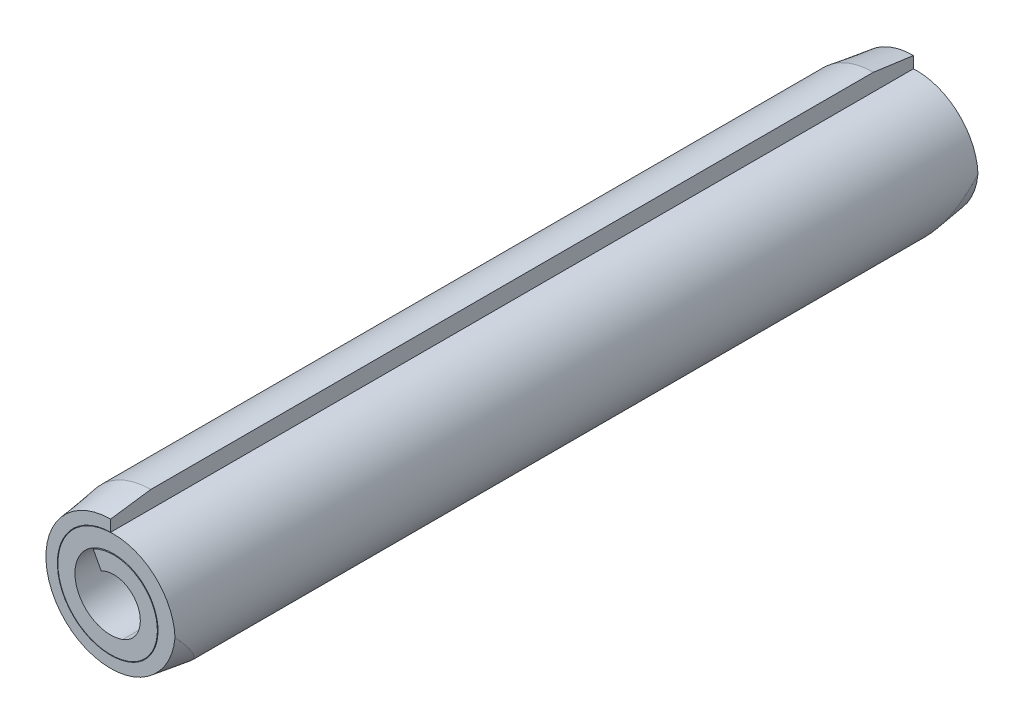
ISO-10303-21;
HEADER;
FILE_DESCRIPTION(('STEP AP214'),'2;1');
FILE_NAME('part.step','',(''),(''),'','','');
FILE_SCHEMA(('AUTOMOTIVE_DESIGN { 1 0 10303 214 1 1 1 1 }'));
ENDSEC;
DATA;
#1=APPLICATION_CONTEXT('core data for automotive mechanical design processes');
#2=APPLICATION_PROTOCOL_DEFINITION('international standard','automotive_design',2000,#1);
#3=PRODUCT_CONTEXT('',#1,'mechanical');
#4=PRODUCT('Part','Part','',(#3));
#5=PRODUCT_RELATED_PRODUCT_CATEGORY('part','',(#4));
#6=PRODUCT_DEFINITION_FORMATION('','',#4);
#7=PRODUCT_DEFINITION_CONTEXT('part definition',#1,'design');
#8=PRODUCT_DEFINITION('design','',#6,#7);
#9=PRODUCT_DEFINITION_SHAPE('','',#8);
#10=(LENGTH_UNIT() NAMED_UNIT(*) SI_UNIT(.MILLI.,.METRE.));
#11=(NAMED_UNIT(*) PLANE_ANGLE_UNIT() SI_UNIT($,.RADIAN.));
#12=(NAMED_UNIT(*) SI_UNIT($,.STERADIAN.) SOLID_ANGLE_UNIT());
#13=UNCERTAINTY_MEASURE_WITH_UNIT(LENGTH_MEASURE(1.E-05),#10,'distance_accuracy_value','');
#14=(GEOMETRIC_REPRESENTATION_CONTEXT(3) GLOBAL_UNCERTAINTY_ASSIGNED_CONTEXT((#13)) GLOBAL_UNIT_ASSIGNED_CONTEXT((#10,
#11,#12)) REPRESENTATION_CONTEXT('',''));
#15=CARTESIAN_POINT('',(0.,0.,0.));
#16=DIRECTION('',(0.,0.,1.));
#17=DIRECTION('',(1.,0.,0.));
#18=AXIS2_PLACEMENT_3D('',#15,#16,#17);
#19=CARTESIAN_POINT('',(-0.211085830625034,0.338291437783564,-9.));
#20=DIRECTION('',(0.883353817881994,0.468706765935062,0.));
#21=DIRECTION('',(-0.468706765935062,0.883353817881994,0.));
#22=AXIS2_PLACEMENT_3D('',#19,#20,#21);
#23=PLANE('',#22);
#24=DIRECTION('',(0.,0.,1.));
#25=VECTOR('',#24,1.);
#26=CARTESIAN_POINT('',(-0.390102521039357,0.675677386600868,-9.));
#27=LINE('',#26,#25);
#28=CARTESIAN_POINT('',(-0.390102521039357,0.675677386600868,-9.));
#29=VERTEX_POINT('',#28);
#30=CARTESIAN_POINT('',(-0.390102521039357,0.675677386600868,9.));
#31=VERTEX_POINT('',#30);
#32=EDGE_CURVE('E241',#29,#31,#27,.T.);
#33=ORIENTED_EDGE('',*,*,#32,.F.);
#34=DIRECTION('',(-0.468706765935062,0.883353817881994,0.));
#35=VECTOR('',#34,1.);
#36=CARTESIAN_POINT('',(-0.211085830625034,0.338291437783564,-9.));
#37=LINE('',#36,#35);
#38=CARTESIAN_POINT('',(-0.211085830625034,0.338291437783564,-9.));
#39=VERTEX_POINT('',#38);
#40=EDGE_CURVE('E125',#39,#29,#37,.T.);
#41=ORIENTED_EDGE('',*,*,#40,.F.);
#42=DIRECTION('',(0.,0.,1.));
#43=VECTOR('',#42,1.);
#44=CARTESIAN_POINT('',(-0.211085830625034,0.338291437783564,-9.));
#45=LINE('',#44,#43);
#46=CARTESIAN_POINT('',(-0.211085830625034,0.338291437783564,9.));
#47=VERTEX_POINT('',#46);
#48=EDGE_CURVE('E109',#47,#39,#45,.F.);
#49=ORIENTED_EDGE('',*,*,#48,.F.);
#50=DIRECTION('',(-0.468706765935062,0.883353817881994,0.));
#51=VECTOR('',#50,1.);
#52=CARTESIAN_POINT('',(-0.211085830625034,0.338291437783564,9.));
#53=LINE('',#52,#51);
#54=EDGE_CURVE('E116',#31,#47,#53,.F.);
#55=ORIENTED_EDGE('',*,*,#54,.F.);
#56=EDGE_LOOP('',(#33,#41,#49,#55));
#57=FACE_BOUND('',#56,.T.);
#58=ADVANCED_FACE('F16',(#57),#23,.F.);
#59=CARTESIAN_POINT('',(0.0689996919525346,-0.189575095588917,-9.));
#60=DIRECTION('',(0.,0.,1.));
#61=DIRECTION('',(1.,0.,0.));
#62=AXIS2_PLACEMENT_3D('',#59,#60,#61);
#63=CYLINDRICAL_SURFACE('',#62,0.597570897059278);
#64=CARTESIAN_POINT('',(0.0689996919525346,-0.189575095588917,-9.));
#65=DIRECTION('',(0.,0.,1.));
#66=DIRECTION('',(1.,0.,0.));
#67=AXIS2_PLACEMENT_3D('',#64,#65,#66);
#68=CIRCLE('',#67,0.597570897059278);
#69=CARTESIAN_POINT('',(0.273380975811996,-0.751108057951937,-9.));
#70=VERTEX_POINT('',#69);
#71=EDGE_CURVE('E101',#70,#39,#68,.T.);
#72=ORIENTED_EDGE('',*,*,#71,.F.);
#73=DIRECTION('',(0.,0.,1.));
#74=VECTOR('',#73,1.);
#75=CARTESIAN_POINT('',(0.273380975811998,-0.751108057951936,-9.));
#76=LINE('',#75,#74);
#77=CARTESIAN_POINT('',(0.273380975811996,-0.751108057951937,9.));
#78=VERTEX_POINT('',#77);
#79=EDGE_CURVE('E112',#70,#78,#76,.T.);
#80=ORIENTED_EDGE('',*,*,#79,.T.);
#81=CARTESIAN_POINT('',(0.0689996919525346,-0.189575095588917,9.));
#82=DIRECTION('',(0.,0.,1.));
#83=DIRECTION('',(1.,0.,0.));
#84=AXIS2_PLACEMENT_3D('',#81,#82,#83);
#85=CIRCLE('',#84,0.597570897059278);
#86=EDGE_CURVE('E19',#47,#78,#85,.F.);
#87=ORIENTED_EDGE('',*,*,#86,.F.);
#88=ORIENTED_EDGE('',*,*,#48,.T.);
#89=EDGE_LOOP('',(#72,#80,#87,#88));
#90=FACE_BOUND('',#89,.T.);
#91=ADVANCED_FACE('F107',(#90),#63,.F.);
#92=CARTESIAN_POINT('',(0.,0.,-9.));
#93=DIRECTION('',(0.,0.,1.));
#94=DIRECTION('',(1.,0.,0.));
#95=AXIS2_PLACEMENT_3D('',#92,#93,#94);
#96=CYLINDRICAL_SURFACE('',#95,1.18125);
#97=CARTESIAN_POINT('',(0.,0.,-9.));
#98=DIRECTION('',(0.,0.,1.));
#99=DIRECTION('',(1.,0.,0.));
#100=AXIS2_PLACEMENT_3D('',#97,#98,#99);
#101=CIRCLE('',#100,1.18125);
#102=CARTESIAN_POINT('',(-0.404011294303447,1.11001190830335,-9.));
#103=VERTEX_POINT('',#102);
#104=CARTESIAN_POINT('',(0.404011294303443,-1.11001190830336,-9.));
#105=VERTEX_POINT('',#104);
#106=EDGE_CURVE('E261',#103,#105,#101,.T.);
#107=ORIENTED_EDGE('',*,*,#106,.T.);
#108=DIRECTION('',(0.,0.,1.));
#109=VECTOR('',#108,1.);
#110=CARTESIAN_POINT('',(0.404011294303446,-1.11001190830335,-9.));
#111=LINE('',#110,#109);
#112=CARTESIAN_POINT('',(0.404011294303443,-1.11001190830336,9.));
#113=VERTEX_POINT('',#112);
#114=EDGE_CURVE('E243',#105,#113,#111,.T.);
#115=ORIENTED_EDGE('',*,*,#114,.T.);
#116=CARTESIAN_POINT('',(0.,0.,9.));
#117=DIRECTION('',(0.,0.,1.));
#118=DIRECTION('',(1.,0.,0.));
#119=AXIS2_PLACEMENT_3D('',#116,#117,#118);
#120=CIRCLE('',#119,1.18125);
#121=CARTESIAN_POINT('',(-0.404011294303447,1.11001190830335,9.));
#122=VERTEX_POINT('',#121);
#123=EDGE_CURVE('E253',#122,#113,#120,.T.);
#124=ORIENTED_EDGE('',*,*,#123,.F.);
#125=DIRECTION('',(0.,0.,1.));
#126=VECTOR('',#125,1.);
#127=CARTESIAN_POINT('',(-0.404011294303447,1.11001190830335,-9.));
#128=LINE('',#127,#126);
#129=EDGE_CURVE('E232',#103,#122,#128,.T.);
#130=ORIENTED_EDGE('',*,*,#129,.F.);
#131=EDGE_LOOP('',(#107,#115,#124,#130));
#132=FACE_BOUND('',#131,.T.);
#133=ADVANCED_FACE('F180',(#132),#96,.T.);
#134=CARTESIAN_POINT('',(0.0689996919525346,-0.189575095588917,-9.));
#135=DIRECTION('',(0.,0.,1.));
#136=DIRECTION('',(1.,0.,0.));
#137=AXIS2_PLACEMENT_3D('',#134,#135,#136);
#138=CYLINDRICAL_SURFACE('',#137,0.979508397059278);
#139=ORIENTED_EDGE('',*,*,#32,.T.);
#140=CARTESIAN_POINT('',(0.0689996919525346,-0.189575095588917,9.));
#141=DIRECTION('',(0.,0.,1.));
#142=DIRECTION('',(1.,0.,0.));
#143=AXIS2_PLACEMENT_3D('',#140,#141,#142);
#144=CIRCLE('',#143,0.979508397059278);
#145=EDGE_CURVE('E121',#113,#31,#144,.T.);
#146=ORIENTED_EDGE('',*,*,#145,.F.);
#147=ORIENTED_EDGE('',*,*,#114,.F.);
#148=CARTESIAN_POINT('',(0.0689996919525346,-0.189575095588917,-9.));
#149=DIRECTION('',(0.,0.,1.));
#150=DIRECTION('',(1.,0.,0.));
#151=AXIS2_PLACEMENT_3D('',#148,#149,#150);
#152=CIRCLE('',#151,0.979508397059278);
#153=EDGE_CURVE('E263',#105,#29,#152,.T.);
#154=ORIENTED_EDGE('',*,*,#153,.T.);
#155=EDGE_LOOP('',(#139,#146,#147,#154));
#156=FACE_BOUND('',#155,.T.);
#157=ADVANCED_FACE('F176',(#156),#138,.T.);
#158=CARTESIAN_POINT('',(0.,0.,-9.));
#159=DIRECTION('',(0.,0.,1.));
#160=DIRECTION('',(1.,0.,0.));
#161=AXIS2_PLACEMENT_3D('',#158,#159,#160);
#162=CYLINDRICAL_SURFACE('',#161,0.799312499999999);
#163=ORIENTED_EDGE('',*,*,#79,.F.);
#164=CARTESIAN_POINT('',(0.,0.,-9.));
#165=DIRECTION('',(0.,0.,1.));
#166=DIRECTION('',(1.,0.,0.));
#167=AXIS2_PLACEMENT_3D('',#164,#165,#166);
#168=CIRCLE('',#167,0.799312499999999);
#169=CARTESIAN_POINT('',(-0.273380975811999,0.751108057951935,-9.));
#170=VERTEX_POINT('',#169);
#171=EDGE_CURVE('E266',#70,#170,#168,.F.);
#172=ORIENTED_EDGE('',*,*,#171,.T.);
#173=DIRECTION('',(0.,0.,1.));
#174=VECTOR('',#173,1.);
#175=CARTESIAN_POINT('',(-0.273380975811999,0.751108057951935,-9.));
#176=LINE('',#175,#174);
#177=CARTESIAN_POINT('',(-0.273380975811999,0.751108057951935,9.));
#178=VERTEX_POINT('',#177);
#179=EDGE_CURVE('E235',#170,#178,#176,.T.);
#180=ORIENTED_EDGE('',*,*,#179,.T.);
#181=CARTESIAN_POINT('',(0.,0.,9.));
#182=DIRECTION('',(0.,0.,1.));
#183=DIRECTION('',(1.,0.,0.));
#184=AXIS2_PLACEMENT_3D('',#181,#182,#183);
#185=CIRCLE('',#184,0.799312499999999);
#186=EDGE_CURVE('E256',#78,#178,#185,.F.);
#187=ORIENTED_EDGE('',*,*,#186,.F.);
#188=EDGE_LOOP('',(#163,#172,#180,#187));
#189=FACE_BOUND('',#188,.T.);
#190=ADVANCED_FACE('F172',(#189),#162,.F.);
#191=CARTESIAN_POINT('',(0.0673352157172413,-0.185001984717226,-9.));
#192=DIRECTION('',(0.,0.,1.));
#193=DIRECTION('',(1.,0.,0.));
#194=AXIS2_PLACEMENT_3D('',#191,#192,#193);
#195=CYLINDRICAL_SURFACE('',#194,0.996187499999999);
#196=CARTESIAN_POINT('',(0.0673352157172413,-0.185001984717226,-9.));
#197=DIRECTION('',(0.,0.,1.));
#198=DIRECTION('',(1.,0.,0.));
#199=AXIS2_PLACEMENT_3D('',#196,#197,#198);
#200=CIRCLE('',#199,0.996187499999999);
#201=CARTESIAN_POINT('',(0.408051407246481,-1.12111202738639,-9.));
#202=VERTEX_POINT('',#201);
#203=EDGE_CURVE('E268',#170,#202,#200,.F.);
#204=ORIENTED_EDGE('',*,*,#203,.T.);
#205=DIRECTION('',(0.,0.,1.));
#206=VECTOR('',#205,1.);
#207=CARTESIAN_POINT('',(0.408051407246481,-1.12111202738639,-9.));
#208=LINE('',#207,#206);
#209=CARTESIAN_POINT('',(0.408051407246481,-1.12111202738639,9.));
#210=VERTEX_POINT('',#209);
#211=EDGE_CURVE('E229',#202,#210,#208,.T.);
#212=ORIENTED_EDGE('',*,*,#211,.T.);
#213=CARTESIAN_POINT('',(0.0673352157172413,-0.185001984717226,9.));
#214=DIRECTION('',(0.,0.,1.));
#215=DIRECTION('',(1.,0.,0.));
#216=AXIS2_PLACEMENT_3D('',#213,#214,#215);
#217=CIRCLE('',#216,0.996187499999999);
#218=EDGE_CURVE('E230',#178,#210,#217,.F.);
#219=ORIENTED_EDGE('',*,*,#218,.F.);
#220=ORIENTED_EDGE('',*,*,#179,.F.);
#221=EDGE_LOOP('',(#204,#212,#219,#220));
#222=FACE_BOUND('',#221,.T.);
#223=ADVANCED_FACE('F169',(#222),#195,.F.);
#224=CARTESIAN_POINT('',(0.0689996919525346,-0.189575095588917,9.));
#225=DIRECTION('',(0.,0.,1.));
#226=DIRECTION('',(1.,0.,0.));
#227=AXIS2_PLACEMENT_3D('',#224,#225,#226);
#228=PLANE('',#227);
#229=CARTESIAN_POINT('',(0.,0.,9.));
#230=DIRECTION('',(0.,0.,1.));
#231=DIRECTION('',(1.,0.,0.));
#232=AXIS2_PLACEMENT_3D('',#229,#230,#231);
#233=CIRCLE('',#232,1.1930625);
#234=CARTESIAN_POINT('',(0.,1.1930625,9.));
#235=VERTEX_POINT('',#234);
#236=EDGE_CURVE('E237',#210,#235,#233,.F.);
#237=ORIENTED_EDGE('',*,*,#236,.T.);
#238=DIRECTION('',(0.,1.,0.));
#239=VECTOR('',#238,1.);
#240=CARTESIAN_POINT('',(0.,-0.189575095588917,9.));
#241=LINE('',#240,#239);
#242=CARTESIAN_POINT('',(0.,1.45000000000275,9.00000000000728));
#243=VERTEX_POINT('',#242);
#244=EDGE_CURVE('E228',#235,#243,#241,.T.);
#245=ORIENTED_EDGE('',*,*,#244,.T.);
#246=CARTESIAN_POINT('',(0.,0.,9.00000000001455));
#247=DIRECTION('',(0.,0.,-1.));
#248=DIRECTION('',(-1.,0.,0.));
#249=AXIS2_PLACEMENT_3D('',#246,#247,#248);
#250=CIRCLE('',#249,1.4500000000055);
#251=CARTESIAN_POINT('',(1.44429938850018,-0.12844950911095,8.99999999999959));
#252=VERTEX_POINT('',#251);
#253=EDGE_CURVE('E134',#252,#243,#250,.T.);
#254=ORIENTED_EDGE('',*,*,#253,.F.);
#255=CARTESIAN_POINT('',(0.0673352157172413,-0.185001984717226,9.));
#256=DIRECTION('',(0.,0.,1.));
#257=DIRECTION('',(1.,0.,0.));
#258=AXIS2_PLACEMENT_3D('',#255,#256,#257);
#259=CIRCLE('',#258,1.378125);
#260=EDGE_CURVE('E234',#252,#122,#259,.T.);
#261=ORIENTED_EDGE('',*,*,#260,.T.);
#262=ORIENTED_EDGE('',*,*,#123,.T.);
#263=ORIENTED_EDGE('',*,*,#145,.T.);
#264=ORIENTED_EDGE('',*,*,#54,.T.);
#265=ORIENTED_EDGE('',*,*,#86,.T.);
#266=ORIENTED_EDGE('',*,*,#186,.T.);
#267=ORIENTED_EDGE('',*,*,#218,.T.);
#268=EDGE_LOOP('',(#237,#245,#254,#261,#262,#263,#264,#265,#266,#267));
#269=FACE_BOUND('',#268,.T.);
#270=ADVANCED_FACE('F119',(#269),#228,.T.);
#271=CARTESIAN_POINT('',(0.,0.,-9.));
#272=DIRECTION('',(0.,0.,1.));
#273=DIRECTION('',(1.,0.,0.));
#274=AXIS2_PLACEMENT_3D('',#271,#272,#273);
#275=CYLINDRICAL_SURFACE('',#274,1.1930625);
#276=ORIENTED_EDGE('',*,*,#211,.F.);
#277=CARTESIAN_POINT('',(0.,0.,-9.));
#278=DIRECTION('',(0.,0.,1.));
#279=DIRECTION('',(1.,0.,0.));
#280=AXIS2_PLACEMENT_3D('',#277,#278,#279);
#281=CIRCLE('',#280,1.1930625);
#282=CARTESIAN_POINT('',(0.,1.1930625,-9.));
#283=VERTEX_POINT('',#282);
#284=EDGE_CURVE('E270',#202,#283,#281,.F.);
#285=ORIENTED_EDGE('',*,*,#284,.T.);
#286=DIRECTION('',(0.,0.,1.));
#287=VECTOR('',#286,1.);
#288=CARTESIAN_POINT('',(0.,1.1930625,-9.));
#289=LINE('',#288,#287);
#290=EDGE_CURVE('E137',#283,#235,#289,.T.);
#291=ORIENTED_EDGE('',*,*,#290,.T.);
#292=ORIENTED_EDGE('',*,*,#236,.F.);
#293=EDGE_LOOP('',(#276,#285,#291,#292));
#294=FACE_BOUND('',#293,.T.);
#295=ADVANCED_FACE('F163',(#294),#275,.F.);
#296=CARTESIAN_POINT('',(0.0689996919525346,-0.189575095588917,-9.));
#297=DIRECTION('',(0.,0.,1.));
#298=DIRECTION('',(1.,0.,0.));
#299=AXIS2_PLACEMENT_3D('',#296,#297,#298);
#300=PLANE('',#299);
#301=CARTESIAN_POINT('',(0.0673352157172413,-0.185001984717226,-9.));
#302=DIRECTION('',(0.,0.,1.));
#303=DIRECTION('',(1.,0.,0.));
#304=AXIS2_PLACEMENT_3D('',#301,#302,#303);
#305=CIRCLE('',#304,1.378125);
#306=CARTESIAN_POINT('',(1.4442993884941,-0.128449509048925,-8.99999999999183));
#307=VERTEX_POINT('',#306);
#308=EDGE_CURVE('E271',#307,#103,#305,.T.);
#309=ORIENTED_EDGE('',*,*,#308,.F.);
#310=CARTESIAN_POINT('',(0.,0.,-9.00000000000728));
#311=DIRECTION('',(0.,0.,1.));
#312=DIRECTION('',(1.,0.,0.));
#313=AXIS2_PLACEMENT_3D('',#310,#311,#312);
#314=CIRCLE('',#313,1.44999999999388);
#315=CARTESIAN_POINT('',(0.,1.44999999999827,-9.0000000000357));
#316=VERTEX_POINT('',#315);
#317=EDGE_CURVE('E130',#316,#307,#314,.T.);
#318=ORIENTED_EDGE('',*,*,#317,.F.);
#319=DIRECTION('',(0.,-1.,0.));
#320=VECTOR('',#319,1.);
#321=CARTESIAN_POINT('',(0.,1.575,-9.));
#322=LINE('',#321,#320);
#323=EDGE_CURVE('E133',#316,#283,#322,.T.);
#324=ORIENTED_EDGE('',*,*,#323,.T.);
#325=ORIENTED_EDGE('',*,*,#284,.F.);
#326=ORIENTED_EDGE('',*,*,#203,.F.);
#327=ORIENTED_EDGE('',*,*,#171,.F.);
#328=ORIENTED_EDGE('',*,*,#71,.T.);
#329=ORIENTED_EDGE('',*,*,#40,.T.);
#330=ORIENTED_EDGE('',*,*,#153,.F.);
#331=ORIENTED_EDGE('',*,*,#106,.F.);
#332=EDGE_LOOP('',(#309,#318,#324,#325,#326,#327,#328,#329,#330,#331));
#333=FACE_BOUND('',#332,.T.);
#334=ADVANCED_FACE('F158',(#333),#300,.F.);
#335=CARTESIAN_POINT('',(0.0673352157172413,-0.185001984717226,-9.));
#336=DIRECTION('',(0.,0.,1.));
#337=DIRECTION('',(1.,0.,0.));
#338=AXIS2_PLACEMENT_3D('',#335,#336,#337);
#339=CYLINDRICAL_SURFACE('',#338,1.378125);
#340=CARTESIAN_POINT('',(0.538681725737929,-1.4800158777378,8.10000000013377));
#341=CARTESIAN_POINT('',(0.568457575291803,-1.46918224784146,8.09999713101628));
#342=CARTESIAN_POINT('',(0.597839499243149,-1.45732031822733,8.10098429130596));
#343=CARTESIAN_POINT('',(0.655594090129832,-1.43166818089949,8.10490183378926));
#344=CARTESIAN_POINT('',(0.683967372478445,-1.41787917521204,8.10783100887027));
#345=CARTESIAN_POINT('',(0.766848538637026,-1.3740290993974,8.11941549407509));
#346=CARTESIAN_POINT('',(0.819605068856571,-1.341305849971,8.13086913587589));
#347=CARTESIAN_POINT('',(0.91886350255145,-1.27029254251756,8.16049297442889));
#348=CARTESIAN_POINT('',(0.96537807650679,-1.23201410026104,8.17864927546407));
#349=CARTESIAN_POINT('',(1.05175685498751,-1.15125624233099,8.22072898540391));
#350=CARTESIAN_POINT('',(1.09160909000056,-1.10876947946312,8.24466258924759));
#351=CARTESIAN_POINT('',(1.17710475141354,-1.00570152050876,8.30644462732102));
#352=CARTESIAN_POINT('',(1.21994637778338,-0.943964007703288,8.34623810526463));
#353=CARTESIAN_POINT('',(1.29370887157189,-0.817925509819062,8.43232155733951));
#354=CARTESIAN_POINT('',(1.32460475054872,-0.753619458310551,8.47862487616102));
#355=CARTESIAN_POINT('',(1.38325770469748,-0.604341069078676,8.59105648021862));
#356=CARTESIAN_POINT('',(1.40709324711908,-0.519124290582799,8.65888893123065));
#357=CARTESIAN_POINT('',(1.43818930890035,-0.350375391470358,8.79985561180811));
#358=CARTESIAN_POINT('',(1.44546431248168,-0.266841862084883,8.8729851506042));
#359=CARTESIAN_POINT('',(1.44545926734968,-0.166056720468179,8.96510866235372));
#360=CARTESIAN_POINT('',(1.4450682430972,-0.147202216422362,8.98251560369966));
#361=CARTESIAN_POINT('',(1.44429938849984,-0.128449509102625,9.00000000003007));
#362=B_SPLINE_CURVE_WITH_KNOTS('',3,(#340,#341,#342,#343,#344,#345,#346,#347,#348,#349,#350,
#351,#352,#353,#354,#355,#356,#357,#358,#359,#360,#361),.UNSPECIFIED.,.F.,.F.,(4,2,2,2,2,2,2,2,
2,2,4),(0.,0.0949867724274584,0.189914558504254,0.378235945696181,0.566169084306071,
0.754436315914468,1.00814215783727,1.26237587384423,1.59518693674558,1.92770680354278,
2.00468244131286),.UNSPECIFIED.);
#363=CARTESIAN_POINT('',(0.538681725737929,-1.48001587773781,8.10000000006688));
#364=VERTEX_POINT('',#363);
#365=EDGE_CURVE('E138',#364,#252,#362,.T.);
#366=ORIENTED_EDGE('',*,*,#365,.F.);
#367=DIRECTION('',(0.,0.,1.));
#368=VECTOR('',#367,1.);
#369=CARTESIAN_POINT('',(0.538681725737929,-1.48001587773781,-9.));
#370=LINE('',#369,#368);
#371=CARTESIAN_POINT('',(0.538681725738364,-1.480015877739,-8.10000000000521));
#372=VERTEX_POINT('',#371);
#373=EDGE_CURVE('E219',#372,#364,#370,.T.);
#374=ORIENTED_EDGE('',*,*,#373,.F.);
#375=CARTESIAN_POINT('',(0.538681725737928,-1.4800158777378,-8.09999999999733));
#376=CARTESIAN_POINT('',(0.568457575291395,-1.46918224784161,-8.09999713087984));
#377=CARTESIAN_POINT('',(0.597839499242344,-1.45732031822765,-8.10098429116955));
#378=CARTESIAN_POINT('',(0.65559409012825,-1.43166818090023,-8.10490183365294));
#379=CARTESIAN_POINT('',(0.683967372476484,-1.41787917521301,-8.10783100873402));
#380=CARTESIAN_POINT('',(0.766848538633942,-1.37402909939916,-8.11941549393909));
#381=CARTESIAN_POINT('',(0.819605068852773,-1.34130584997342,-8.13086913574014));
#382=CARTESIAN_POINT('',(0.918863502546322,-1.27029254252153,-8.16049297429373));
#383=CARTESIAN_POINT('',(0.965378076501044,-1.23201410026591,-8.17864927532924));
#384=CARTESIAN_POINT('',(1.05175685498068,-1.15125624233788,-8.22072898526982));
#385=CARTESIAN_POINT('',(1.09160908999328,-1.10876947947113,-8.24466258911388));
#386=CARTESIAN_POINT('',(1.17710475140619,-1.00570152051867,-8.30644462718879));
#387=CARTESIAN_POINT('',(1.21994637777631,-0.94396400771397,-8.34623810513363));
#388=CARTESIAN_POINT('',(1.29370887156546,-0.817925509831453,-8.43232155721112));
#389=CARTESIAN_POINT('',(1.32460475054265,-0.753619458323878,-8.478624876034));
#390=CARTESIAN_POINT('',(1.38325770469693,-0.604341069082856,-8.59105648010344));
#391=CARTESIAN_POINT('',(1.40709324712121,-0.519124290576775,-8.65888893112708));
#392=CARTESIAN_POINT('',(1.43818930890405,-0.350375391444716,-8.79985561172889));
#393=CARTESIAN_POINT('',(1.44546431248429,-0.266841862049826,-8.87298515053772));
#394=CARTESIAN_POINT('',(1.44545926734907,-0.166056720423758,-8.96510866230187));
#395=CARTESIAN_POINT('',(1.44506824309597,-0.147202216377404,-8.98251560364947));
#396=CARTESIAN_POINT('',(1.44429938849797,-0.128449509057147,-8.99999999998152));
#397=B_SPLINE_CURVE_WITH_KNOTS('',3,(#375,#376,#377,#378,#379,#380,#381,#382,#383,#384,#385,
#386,#387,#388,#389,#390,#391,#392,#393,#394,#395,#396),.UNSPECIFIED.,.F.,.F.,(4,2,2,2,2,2,2,2,
2,2,4),(0.,0.0949867724261565,0.189914558501646,0.378235945690907,0.566169084298099,
0.754436315903807,1.00814215782707,1.26237587383457,1.59518693678158,1.92770680362454,
2.00468244139919),.UNSPECIFIED.);
#398=EDGE_CURVE('E145',#372,#307,#397,.T.);
#399=ORIENTED_EDGE('',*,*,#398,.T.);
#400=ORIENTED_EDGE('',*,*,#308,.T.);
#401=ORIENTED_EDGE('',*,*,#129,.T.);
#402=ORIENTED_EDGE('',*,*,#260,.F.);
#403=EDGE_LOOP('',(#366,#374,#399,#400,#401,#402));
#404=FACE_BOUND('',#403,.T.);
#405=ADVANCED_FACE('F154',(#404),#339,.T.);
#406=CARTESIAN_POINT('',(0.,0.,8.1000000000131));
#407=DIRECTION('',(0.,0.,-1.));
#408=DIRECTION('',(-1.,0.,0.));
#409=AXIS2_PLACEMENT_3D('',#406,#407,#408);
#410=CONICAL_SURFACE('',#409,1.57500000001676,0.138006023669568);
#411=DIRECTION('',(0.,0.137568371274688,-0.990492273177751));
#412=VECTOR('',#411,1.);
#413=CARTESIAN_POINT('',(0.,1.45,9.));
#414=LINE('',#413,#412);
#415=CARTESIAN_POINT('',(0.,1.57500000000838,8.10000000000656));
#416=VERTEX_POINT('',#415);
#417=EDGE_CURVE('E211',#243,#416,#414,.T.);
#418=ORIENTED_EDGE('',*,*,#417,.T.);
#419=CARTESIAN_POINT('',(0.,0.,8.1));
#420=DIRECTION('',(0.,0.,1.));
#421=DIRECTION('',(1.,0.,0.));
#422=AXIS2_PLACEMENT_3D('',#419,#420,#421);
#423=CIRCLE('',#422,1.575);
#424=EDGE_CURVE('E213',#364,#416,#423,.F.);
#425=ORIENTED_EDGE('',*,*,#424,.F.);
#426=ORIENTED_EDGE('',*,*,#365,.T.);
#427=ORIENTED_EDGE('',*,*,#253,.T.);
#428=EDGE_LOOP('',(#418,#425,#426,#427));
#429=FACE_BOUND('',#428,.T.);
#430=ADVANCED_FACE('F151',(#429),#410,.T.);
#431=CARTESIAN_POINT('',(0.,1.575,-9.));
#432=DIRECTION('',(-1.,0.,0.));
#433=DIRECTION('',(0.,-1.,0.));
#434=AXIS2_PLACEMENT_3D('',#431,#432,#433);
#435=PLANE('',#434);
#436=DIRECTION('',(0.,-0.137568371274689,-0.990492273177752));
#437=VECTOR('',#436,1.);
#438=CARTESIAN_POINT('',(8.48781333205985E-12,69308.255555556,499000.));
#439=LINE('',#438,#437);
#440=CARTESIAN_POINT('',(0.,1.57500000000419,-8.10000000000328));
#441=VERTEX_POINT('',#440);
#442=EDGE_CURVE('E34',#441,#316,#439,.T.);
#443=ORIENTED_EDGE('',*,*,#442,.F.);
#444=DIRECTION('',(0.,0.,1.));
#445=VECTOR('',#444,1.);
#446=CARTESIAN_POINT('',(0.,1.575,-9.));
#447=LINE('',#446,#445);
#448=EDGE_CURVE('E25',#416,#441,#447,.F.);
#449=ORIENTED_EDGE('',*,*,#448,.F.);
#450=ORIENTED_EDGE('',*,*,#417,.F.);
#451=ORIENTED_EDGE('',*,*,#244,.F.);
#452=ORIENTED_EDGE('',*,*,#290,.F.);
#453=ORIENTED_EDGE('',*,*,#323,.F.);
#454=EDGE_LOOP('',(#443,#449,#450,#451,#452,#453));
#455=FACE_BOUND('',#454,.T.);
#456=ADVANCED_FACE('F198',(#455),#435,.F.);
#457=CARTESIAN_POINT('',(0.,0.,-8.10000000018363));
#458=DIRECTION('',(0.,0.,1.));
#459=DIRECTION('',(1.,0.,0.));
#460=AXIS2_PLACEMENT_3D('',#457,#458,#459);
#461=CONICAL_SURFACE('',#460,1.57499999997413,0.138006023662683);
#462=CARTESIAN_POINT('',(0.,0.,-8.1));
#463=DIRECTION('',(0.,0.,1.));
#464=DIRECTION('',(1.,0.,0.));
#465=AXIS2_PLACEMENT_3D('',#462,#463,#464);
#466=CIRCLE('',#465,1.575);
#467=EDGE_CURVE('E11',#441,#372,#466,.T.);
#468=ORIENTED_EDGE('',*,*,#467,.F.);
#469=ORIENTED_EDGE('',*,*,#442,.T.);
#470=ORIENTED_EDGE('',*,*,#317,.T.);
#471=ORIENTED_EDGE('',*,*,#398,.F.);
#472=EDGE_LOOP('',(#468,#469,#470,#471));
#473=FACE_BOUND('',#472,.T.);
#474=ADVANCED_FACE('F192',(#473),#461,.T.);
#475=CARTESIAN_POINT('',(0.,0.,-9.));
#476=DIRECTION('',(0.,0.,1.));
#477=DIRECTION('',(1.,0.,0.));
#478=AXIS2_PLACEMENT_3D('',#475,#476,#477);
#479=CYLINDRICAL_SURFACE('',#478,1.575);
#480=ORIENTED_EDGE('',*,*,#448,.T.);
#481=ORIENTED_EDGE('',*,*,#467,.T.);
#482=ORIENTED_EDGE('',*,*,#373,.T.);
#483=ORIENTED_EDGE('',*,*,#424,.T.);
#484=EDGE_LOOP('',(#480,#481,#482,#483));
#485=FACE_BOUND('',#484,.T.);
#486=ADVANCED_FACE('F190',(#485),#479,.T.);
#487=CLOSED_SHELL('',(#58,#91,#133,#157,#190,#223,#270,#295,#334,#405,#430,#456,#474,#486));
#488=MANIFOLD_SOLID_BREP('B1',#487);
#489=ADVANCED_BREP_SHAPE_REPRESENTATION('',(#18,#488),#14);
#490=SHAPE_DEFINITION_REPRESENTATION(#9,#489);
ENDSEC;
END-ISO-10303-21;
